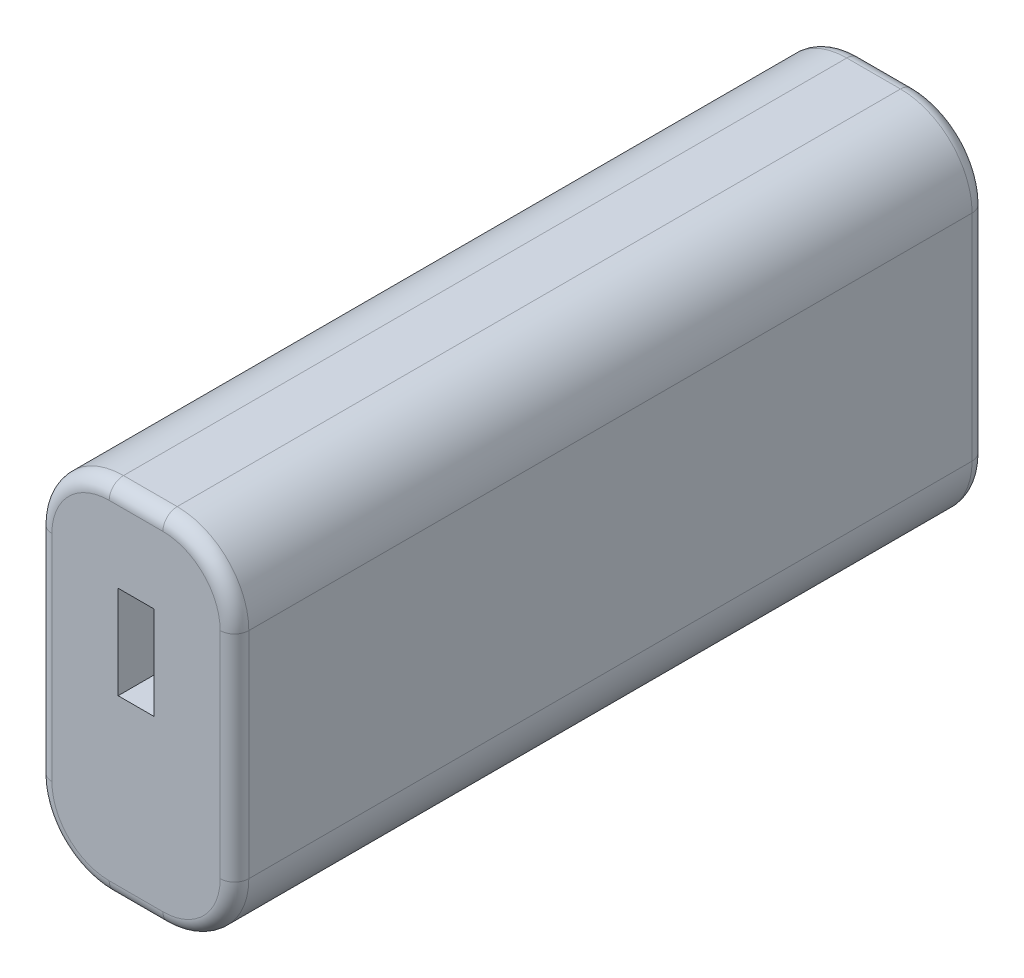
ISO-10303-21;
HEADER;
FILE_DESCRIPTION(('STEP AP214'),'2;1');
FILE_NAME('part.step','',(''),(''),'','','');
FILE_SCHEMA(('AUTOMOTIVE_DESIGN { 1 0 10303 214 1 1 1 1 }'));
ENDSEC;
DATA;
#1=APPLICATION_CONTEXT('core data for automotive mechanical design processes');
#2=APPLICATION_PROTOCOL_DEFINITION('international standard','automotive_design',2000,#1);
#3=PRODUCT_CONTEXT('',#1,'mechanical');
#4=PRODUCT('Part','Part','',(#3));
#5=PRODUCT_RELATED_PRODUCT_CATEGORY('part','',(#4));
#6=PRODUCT_DEFINITION_FORMATION('','',#4);
#7=PRODUCT_DEFINITION_CONTEXT('part definition',#1,'design');
#8=PRODUCT_DEFINITION('design','',#6,#7);
#9=PRODUCT_DEFINITION_SHAPE('','',#8);
#10=(LENGTH_UNIT() NAMED_UNIT(*) SI_UNIT(.MILLI.,.METRE.));
#11=(NAMED_UNIT(*) PLANE_ANGLE_UNIT() SI_UNIT($,.RADIAN.));
#12=(NAMED_UNIT(*) SI_UNIT($,.STERADIAN.) SOLID_ANGLE_UNIT());
#13=UNCERTAINTY_MEASURE_WITH_UNIT(LENGTH_MEASURE(1.E-05),#10,'distance_accuracy_value','');
#14=(GEOMETRIC_REPRESENTATION_CONTEXT(3) GLOBAL_UNCERTAINTY_ASSIGNED_CONTEXT((#13)) GLOBAL_UNIT_ASSIGNED_CONTEXT((#10,
#11,#12)) REPRESENTATION_CONTEXT('',''));
#15=CARTESIAN_POINT('',(0.,0.,0.));
#16=DIRECTION('',(0.,0.,1.));
#17=DIRECTION('',(1.,0.,0.));
#18=AXIS2_PLACEMENT_3D('',#15,#16,#17);
#19=CARTESIAN_POINT('',(17.5,10.,105.));
#20=DIRECTION('',(0.,0.,-1.));
#21=DIRECTION('',(-1.,0.,0.));
#22=AXIS2_PLACEMENT_3D('',#19,#20,#21);
#23=CYLINDRICAL_SURFACE('',#22,10.);
#24=DIRECTION('',(0.,0.,-1.));
#25=VECTOR('',#24,1.);
#26=CARTESIAN_POINT('',(17.4999999999999,0.,105.));
#27=LINE('',#26,#25);
#28=CARTESIAN_POINT('',(17.4999999999999,0.,103.));
#29=VERTEX_POINT('',#28);
#30=CARTESIAN_POINT('',(17.4999999999999,0.,2.));
#31=VERTEX_POINT('',#30);
#32=EDGE_CURVE('E214',#29,#31,#27,.T.);
#33=ORIENTED_EDGE('',*,*,#32,.T.);
#34=CARTESIAN_POINT('',(17.5,10.,2.));
#35=DIRECTION('',(0.,0.,-1.));
#36=DIRECTION('',(-1.,0.,0.));
#37=AXIS2_PLACEMENT_3D('',#34,#35,#36);
#38=CIRCLE('',#37,10.);
#39=CARTESIAN_POINT('',(27.5,10.0000000000001,2.));
#40=VERTEX_POINT('',#39);
#41=EDGE_CURVE('E241',#31,#40,#38,.F.);
#42=ORIENTED_EDGE('',*,*,#41,.T.);
#43=DIRECTION('',(0.,0.,-1.));
#44=VECTOR('',#43,1.);
#45=CARTESIAN_POINT('',(27.5,10.0000000000001,105.));
#46=LINE('',#45,#44);
#47=CARTESIAN_POINT('',(27.5,10.0000000000001,103.));
#48=VERTEX_POINT('',#47);
#49=EDGE_CURVE('E236',#48,#40,#46,.T.);
#50=ORIENTED_EDGE('',*,*,#49,.F.);
#51=CARTESIAN_POINT('',(17.5,10.,103.));
#52=DIRECTION('',(0.,0.,-1.));
#53=DIRECTION('',(-1.,0.,0.));
#54=AXIS2_PLACEMENT_3D('',#51,#52,#53);
#55=CIRCLE('',#54,10.);
#56=EDGE_CURVE('E239',#48,#29,#55,.T.);
#57=ORIENTED_EDGE('',*,*,#56,.T.);
#58=EDGE_LOOP('',(#33,#42,#50,#57));
#59=FACE_BOUND('',#58,.T.);
#60=ADVANCED_FACE('F33',(#59),#23,.T.);
#61=CARTESIAN_POINT('',(27.5,39.9999999999999,105.));
#62=DIRECTION('',(-1.,0.,0.));
#63=DIRECTION('',(0.,0.,1.));
#64=AXIS2_PLACEMENT_3D('',#61,#62,#63);
#65=PLANE('',#64);
#66=DIRECTION('',(0.,0.,-1.));
#67=VECTOR('',#66,1.);
#68=CARTESIAN_POINT('',(27.5,39.9999999999999,105.));
#69=LINE('',#68,#67);
#70=CARTESIAN_POINT('',(27.5,39.9999999999999,103.));
#71=VERTEX_POINT('',#70);
#72=CARTESIAN_POINT('',(27.5,39.9999999999999,2.));
#73=VERTEX_POINT('',#72);
#74=EDGE_CURVE('E233',#71,#73,#69,.T.);
#75=ORIENTED_EDGE('',*,*,#74,.F.);
#76=DIRECTION('',(0.,1.,0.));
#77=VECTOR('',#76,1.);
#78=CARTESIAN_POINT('',(27.5,39.9999999999999,103.));
#79=LINE('',#78,#77);
#80=EDGE_CURVE('E11',#71,#48,#79,.F.);
#81=ORIENTED_EDGE('',*,*,#80,.T.);
#82=ORIENTED_EDGE('',*,*,#49,.T.);
#83=DIRECTION('',(0.,1.,0.));
#84=VECTOR('',#83,1.);
#85=CARTESIAN_POINT('',(27.5,39.9999999999999,2.));
#86=LINE('',#85,#84);
#87=EDGE_CURVE('E42',#40,#73,#86,.T.);
#88=ORIENTED_EDGE('',*,*,#87,.T.);
#89=EDGE_LOOP('',(#75,#81,#82,#88));
#90=FACE_BOUND('',#89,.T.);
#91=ADVANCED_FACE('F406',(#90),#65,.F.);
#92=CARTESIAN_POINT('',(17.5,40.,105.));
#93=DIRECTION('',(0.,0.,-1.));
#94=DIRECTION('',(-1.,0.,0.));
#95=AXIS2_PLACEMENT_3D('',#92,#93,#94);
#96=CYLINDRICAL_SURFACE('',#95,10.);
#97=ORIENTED_EDGE('',*,*,#74,.T.);
#98=CARTESIAN_POINT('',(17.5,40.,2.));
#99=DIRECTION('',(0.,0.,-1.));
#100=DIRECTION('',(-1.,0.,0.));
#101=AXIS2_PLACEMENT_3D('',#98,#99,#100);
#102=CIRCLE('',#101,10.);
#103=CARTESIAN_POINT('',(17.4999999999999,50.,2.));
#104=VERTEX_POINT('',#103);
#105=EDGE_CURVE('E283',#73,#104,#102,.F.);
#106=ORIENTED_EDGE('',*,*,#105,.T.);
#107=DIRECTION('',(0.,0.,-1.));
#108=VECTOR('',#107,1.);
#109=CARTESIAN_POINT('',(17.4999999999999,50.,105.));
#110=LINE('',#109,#108);
#111=CARTESIAN_POINT('',(17.4999999999999,50.,103.));
#112=VERTEX_POINT('',#111);
#113=EDGE_CURVE('E230',#112,#104,#110,.T.);
#114=ORIENTED_EDGE('',*,*,#113,.F.);
#115=CARTESIAN_POINT('',(17.5,40.,103.));
#116=DIRECTION('',(0.,0.,-1.));
#117=DIRECTION('',(-1.,0.,0.));
#118=AXIS2_PLACEMENT_3D('',#115,#116,#117);
#119=CIRCLE('',#118,10.);
#120=EDGE_CURVE('E281',#112,#71,#119,.T.);
#121=ORIENTED_EDGE('',*,*,#120,.T.);
#122=EDGE_LOOP('',(#97,#106,#114,#121));
#123=FACE_BOUND('',#122,.T.);
#124=ADVANCED_FACE('F435',(#123),#96,.T.);
#125=CARTESIAN_POINT('',(10.0000000000001,50.,105.));
#126=DIRECTION('',(0.,-1.,0.));
#127=DIRECTION('',(0.,0.,-1.));
#128=AXIS2_PLACEMENT_3D('',#125,#126,#127);
#129=PLANE('',#128);
#130=ORIENTED_EDGE('',*,*,#113,.T.);
#131=DIRECTION('',(-1.,0.,0.));
#132=VECTOR('',#131,1.);
#133=CARTESIAN_POINT('',(10.0000000000001,50.,2.));
#134=LINE('',#133,#132);
#135=CARTESIAN_POINT('',(10.0000000000001,50.,2.));
#136=VERTEX_POINT('',#135);
#137=EDGE_CURVE('E279',#104,#136,#134,.T.);
#138=ORIENTED_EDGE('',*,*,#137,.T.);
#139=DIRECTION('',(0.,0.,-1.));
#140=VECTOR('',#139,1.);
#141=CARTESIAN_POINT('',(10.0000000000001,50.,105.));
#142=LINE('',#141,#140);
#143=CARTESIAN_POINT('',(10.0000000000001,50.,103.));
#144=VERTEX_POINT('',#143);
#145=EDGE_CURVE('E227',#144,#136,#142,.T.);
#146=ORIENTED_EDGE('',*,*,#145,.F.);
#147=DIRECTION('',(-1.,0.,0.));
#148=VECTOR('',#147,1.);
#149=CARTESIAN_POINT('',(10.0000000000001,50.,103.));
#150=LINE('',#149,#148);
#151=EDGE_CURVE('E277',#144,#112,#150,.F.);
#152=ORIENTED_EDGE('',*,*,#151,.T.);
#153=EDGE_LOOP('',(#130,#138,#146,#152));
#154=FACE_BOUND('',#153,.T.);
#155=ADVANCED_FACE('F552',(#154),#129,.F.);
#156=CARTESIAN_POINT('',(10.,40.,105.));
#157=DIRECTION('',(0.,0.,-1.));
#158=DIRECTION('',(-1.,0.,0.));
#159=AXIS2_PLACEMENT_3D('',#156,#157,#158);
#160=CYLINDRICAL_SURFACE('',#159,10.);
#161=ORIENTED_EDGE('',*,*,#145,.T.);
#162=CARTESIAN_POINT('',(10.,40.,2.));
#163=DIRECTION('',(0.,0.,-1.));
#164=DIRECTION('',(-1.,0.,0.));
#165=AXIS2_PLACEMENT_3D('',#162,#163,#164);
#166=CIRCLE('',#165,10.);
#167=CARTESIAN_POINT('',(0.,39.9999999999999,2.));
#168=VERTEX_POINT('',#167);
#169=EDGE_CURVE('E275',#136,#168,#166,.F.);
#170=ORIENTED_EDGE('',*,*,#169,.T.);
#171=DIRECTION('',(0.,0.,-1.));
#172=VECTOR('',#171,1.);
#173=CARTESIAN_POINT('',(0.,39.9999999999999,105.));
#174=LINE('',#173,#172);
#175=CARTESIAN_POINT('',(0.,39.9999999999999,103.));
#176=VERTEX_POINT('',#175);
#177=EDGE_CURVE('E224',#176,#168,#174,.T.);
#178=ORIENTED_EDGE('',*,*,#177,.F.);
#179=CARTESIAN_POINT('',(10.,40.,103.));
#180=DIRECTION('',(0.,0.,-1.));
#181=DIRECTION('',(-1.,0.,0.));
#182=AXIS2_PLACEMENT_3D('',#179,#180,#181);
#183=CIRCLE('',#182,10.);
#184=EDGE_CURVE('E273',#176,#144,#183,.T.);
#185=ORIENTED_EDGE('',*,*,#184,.T.);
#186=EDGE_LOOP('',(#161,#170,#178,#185));
#187=FACE_BOUND('',#186,.T.);
#188=ADVANCED_FACE('F358',(#187),#160,.T.);
#189=CARTESIAN_POINT('',(0.,10.0000000000001,105.));
#190=DIRECTION('',(1.,0.,0.));
#191=DIRECTION('',(0.,0.,-1.));
#192=AXIS2_PLACEMENT_3D('',#189,#190,#191);
#193=PLANE('',#192);
#194=ORIENTED_EDGE('',*,*,#177,.T.);
#195=DIRECTION('',(0.,-1.,0.));
#196=VECTOR('',#195,1.);
#197=CARTESIAN_POINT('',(0.,10.0000000000001,2.));
#198=LINE('',#197,#196);
#199=CARTESIAN_POINT('',(0.,10.0000000000001,2.));
#200=VERTEX_POINT('',#199);
#201=EDGE_CURVE('E271',#168,#200,#198,.T.);
#202=ORIENTED_EDGE('',*,*,#201,.T.);
#203=DIRECTION('',(0.,0.,-1.));
#204=VECTOR('',#203,1.);
#205=CARTESIAN_POINT('',(0.,10.0000000000001,105.));
#206=LINE('',#205,#204);
#207=CARTESIAN_POINT('',(0.,10.0000000000001,103.));
#208=VERTEX_POINT('',#207);
#209=EDGE_CURVE('E221',#208,#200,#206,.T.);
#210=ORIENTED_EDGE('',*,*,#209,.F.);
#211=DIRECTION('',(0.,-1.,0.));
#212=VECTOR('',#211,1.);
#213=CARTESIAN_POINT('',(0.,10.0000000000001,103.));
#214=LINE('',#213,#212);
#215=EDGE_CURVE('E269',#208,#176,#214,.F.);
#216=ORIENTED_EDGE('',*,*,#215,.T.);
#217=EDGE_LOOP('',(#194,#202,#210,#216));
#218=FACE_BOUND('',#217,.T.);
#219=ADVANCED_FACE('F355',(#218),#193,.F.);
#220=CARTESIAN_POINT('',(10.,10.,105.));
#221=DIRECTION('',(0.,0.,-1.));
#222=DIRECTION('',(-1.,0.,0.));
#223=AXIS2_PLACEMENT_3D('',#220,#221,#222);
#224=CYLINDRICAL_SURFACE('',#223,10.);
#225=ORIENTED_EDGE('',*,*,#209,.T.);
#226=CARTESIAN_POINT('',(10.,10.,2.));
#227=DIRECTION('',(0.,0.,-1.));
#228=DIRECTION('',(-1.,0.,0.));
#229=AXIS2_PLACEMENT_3D('',#226,#227,#228);
#230=CIRCLE('',#229,10.);
#231=CARTESIAN_POINT('',(10.0000000000001,0.,2.));
#232=VERTEX_POINT('',#231);
#233=EDGE_CURVE('E267',#200,#232,#230,.F.);
#234=ORIENTED_EDGE('',*,*,#233,.T.);
#235=DIRECTION('',(0.,0.,-1.));
#236=VECTOR('',#235,1.);
#237=CARTESIAN_POINT('',(10.0000000000001,0.,105.));
#238=LINE('',#237,#236);
#239=CARTESIAN_POINT('',(10.0000000000001,0.,103.));
#240=VERTEX_POINT('',#239);
#241=EDGE_CURVE('E217',#240,#232,#238,.T.);
#242=ORIENTED_EDGE('',*,*,#241,.F.);
#243=CARTESIAN_POINT('',(10.,10.,103.));
#244=DIRECTION('',(0.,0.,-1.));
#245=DIRECTION('',(-1.,0.,0.));
#246=AXIS2_PLACEMENT_3D('',#243,#244,#245);
#247=CIRCLE('',#246,10.);
#248=EDGE_CURVE('E265',#240,#208,#247,.T.);
#249=ORIENTED_EDGE('',*,*,#248,.T.);
#250=EDGE_LOOP('',(#225,#234,#242,#249));
#251=FACE_BOUND('',#250,.T.);
#252=ADVANCED_FACE('F381',(#251),#224,.T.);
#253=CARTESIAN_POINT('',(17.4999999999999,0.,105.));
#254=DIRECTION('',(0.,1.,0.));
#255=DIRECTION('',(0.,0.,1.));
#256=AXIS2_PLACEMENT_3D('',#253,#254,#255);
#257=PLANE('',#256);
#258=ORIENTED_EDGE('',*,*,#241,.T.);
#259=DIRECTION('',(1.,0.,0.));
#260=VECTOR('',#259,1.);
#261=CARTESIAN_POINT('',(17.4999999999999,0.,2.));
#262=LINE('',#261,#260);
#263=EDGE_CURVE('E263',#232,#31,#262,.T.);
#264=ORIENTED_EDGE('',*,*,#263,.T.);
#265=ORIENTED_EDGE('',*,*,#32,.F.);
#266=DIRECTION('',(1.,0.,0.));
#267=VECTOR('',#266,1.);
#268=CARTESIAN_POINT('',(17.4999999999999,0.,103.));
#269=LINE('',#268,#267);
#270=EDGE_CURVE('E261',#29,#240,#269,.F.);
#271=ORIENTED_EDGE('',*,*,#270,.T.);
#272=EDGE_LOOP('',(#258,#264,#265,#271));
#273=FACE_BOUND('',#272,.T.);
#274=ADVANCED_FACE('F385',(#273),#257,.F.);
#275=CARTESIAN_POINT('',(17.5,10.,105.));
#276=DIRECTION('',(0.,0.,-1.));
#277=DIRECTION('',(-1.,0.,0.));
#278=AXIS2_PLACEMENT_3D('',#275,#276,#277);
#279=PLANE('',#278);
#280=DIRECTION('',(-1.,0.,0.));
#281=VECTOR('',#280,1.);
#282=CARTESIAN_POINT('',(13.75,38.,105.));
#283=LINE('',#282,#281);
#284=CARTESIAN_POINT('',(16.25,38.,105.));
#285=VERTEX_POINT('',#284);
#286=CARTESIAN_POINT('',(11.25,38.,105.));
#287=VERTEX_POINT('',#286);
#288=EDGE_CURVE('E188',#285,#287,#283,.T.);
#289=ORIENTED_EDGE('',*,*,#288,.F.);
#290=DIRECTION('',(0.,1.,0.));
#291=VECTOR('',#290,1.);
#292=CARTESIAN_POINT('',(16.25,38.,105.));
#293=LINE('',#292,#291);
#294=CARTESIAN_POINT('',(16.25,25.,105.));
#295=VERTEX_POINT('',#294);
#296=EDGE_CURVE('E50',#295,#285,#293,.T.);
#297=ORIENTED_EDGE('',*,*,#296,.F.);
#298=DIRECTION('',(1.,0.,0.));
#299=VECTOR('',#298,1.);
#300=CARTESIAN_POINT('',(16.25,25.,105.));
#301=LINE('',#300,#299);
#302=CARTESIAN_POINT('',(11.25,25.,105.));
#303=VERTEX_POINT('',#302);
#304=EDGE_CURVE('E204',#303,#295,#301,.T.);
#305=ORIENTED_EDGE('',*,*,#304,.F.);
#306=DIRECTION('',(0.,-1.,0.));
#307=VECTOR('',#306,1.);
#308=CARTESIAN_POINT('',(11.25,25.,105.));
#309=LINE('',#308,#307);
#310=EDGE_CURVE('E202',#287,#303,#309,.T.);
#311=ORIENTED_EDGE('',*,*,#310,.F.);
#312=EDGE_LOOP('',(#289,#297,#305,#311));
#313=FACE_BOUND('',#312,.T.);
#314=CARTESIAN_POINT('',(17.5,10.,105.));
#315=DIRECTION('',(0.,0.,-1.));
#316=DIRECTION('',(-1.,0.,0.));
#317=AXIS2_PLACEMENT_3D('',#314,#315,#316);
#318=CIRCLE('',#317,8.);
#319=CARTESIAN_POINT('',(17.4999999999999,2.,105.));
#320=VERTEX_POINT('',#319);
#321=CARTESIAN_POINT('',(25.5,10.0000000000001,105.));
#322=VERTEX_POINT('',#321);
#323=EDGE_CURVE('E58',#320,#322,#318,.F.);
#324=ORIENTED_EDGE('',*,*,#323,.T.);
#325=DIRECTION('',(0.,1.,0.));
#326=VECTOR('',#325,1.);
#327=CARTESIAN_POINT('',(25.5,10.,105.));
#328=LINE('',#327,#326);
#329=CARTESIAN_POINT('',(25.5,39.9999999999999,105.));
#330=VERTEX_POINT('',#329);
#331=EDGE_CURVE('E298',#322,#330,#328,.T.);
#332=ORIENTED_EDGE('',*,*,#331,.T.);
#333=CARTESIAN_POINT('',(17.5,40.,105.));
#334=DIRECTION('',(0.,0.,-1.));
#335=DIRECTION('',(-1.,0.,0.));
#336=AXIS2_PLACEMENT_3D('',#333,#334,#335);
#337=CIRCLE('',#336,8.);
#338=CARTESIAN_POINT('',(17.4999999999999,48.,105.));
#339=VERTEX_POINT('',#338);
#340=EDGE_CURVE('E285',#330,#339,#337,.F.);
#341=ORIENTED_EDGE('',*,*,#340,.T.);
#342=DIRECTION('',(-1.,0.,0.));
#343=VECTOR('',#342,1.);
#344=CARTESIAN_POINT('',(17.5,48.,105.));
#345=LINE('',#344,#343);
#346=CARTESIAN_POINT('',(10.0000000000001,48.,105.));
#347=VERTEX_POINT('',#346);
#348=EDGE_CURVE('E287',#339,#347,#345,.T.);
#349=ORIENTED_EDGE('',*,*,#348,.T.);
#350=CARTESIAN_POINT('',(10.,40.,105.));
#351=DIRECTION('',(0.,0.,-1.));
#352=DIRECTION('',(-1.,0.,0.));
#353=AXIS2_PLACEMENT_3D('',#350,#351,#352);
#354=CIRCLE('',#353,8.);
#355=CARTESIAN_POINT('',(2.,39.9999999999999,105.));
#356=VERTEX_POINT('',#355);
#357=EDGE_CURVE('E289',#347,#356,#354,.F.);
#358=ORIENTED_EDGE('',*,*,#357,.T.);
#359=DIRECTION('',(0.,-1.,0.));
#360=VECTOR('',#359,1.);
#361=CARTESIAN_POINT('',(2.,10.,105.));
#362=LINE('',#361,#360);
#363=CARTESIAN_POINT('',(2.,10.0000000000001,105.));
#364=VERTEX_POINT('',#363);
#365=EDGE_CURVE('E291',#356,#364,#362,.T.);
#366=ORIENTED_EDGE('',*,*,#365,.T.);
#367=CARTESIAN_POINT('',(10.,10.,105.));
#368=DIRECTION('',(0.,0.,-1.));
#369=DIRECTION('',(-1.,0.,0.));
#370=AXIS2_PLACEMENT_3D('',#367,#368,#369);
#371=CIRCLE('',#370,8.);
#372=CARTESIAN_POINT('',(10.0000000000001,2.,105.));
#373=VERTEX_POINT('',#372);
#374=EDGE_CURVE('E293',#364,#373,#371,.F.);
#375=ORIENTED_EDGE('',*,*,#374,.T.);
#376=DIRECTION('',(1.,0.,0.));
#377=VECTOR('',#376,1.);
#378=CARTESIAN_POINT('',(17.5,2.,105.));
#379=LINE('',#378,#377);
#380=EDGE_CURVE('E295',#373,#320,#379,.T.);
#381=ORIENTED_EDGE('',*,*,#380,.T.);
#382=EDGE_LOOP('',(#324,#332,#341,#349,#358,#366,#375,#381));
#383=FACE_BOUND('',#382,.T.);
#384=ADVANCED_FACE('F419',(#313,#383),#279,.F.);
#385=CARTESIAN_POINT('',(17.5,10.,0.));
#386=DIRECTION('',(0.,0.,-1.));
#387=DIRECTION('',(-1.,0.,0.));
#388=AXIS2_PLACEMENT_3D('',#385,#386,#387);
#389=PLANE('',#388);
#390=DIRECTION('',(0.,1.,0.));
#391=VECTOR('',#390,1.);
#392=CARTESIAN_POINT('',(25.5,10.0000000000001,0.));
#393=LINE('',#392,#391);
#394=CARTESIAN_POINT('',(25.5,39.9999999999999,0.));
#395=VERTEX_POINT('',#394);
#396=CARTESIAN_POINT('',(25.5,10.0000000000001,0.));
#397=VERTEX_POINT('',#396);
#398=EDGE_CURVE('E244',#395,#397,#393,.F.);
#399=ORIENTED_EDGE('',*,*,#398,.T.);
#400=CARTESIAN_POINT('',(17.5,10.,0.));
#401=DIRECTION('',(0.,0.,-1.));
#402=DIRECTION('',(-1.,0.,0.));
#403=AXIS2_PLACEMENT_3D('',#400,#401,#402);
#404=CIRCLE('',#403,8.);
#405=CARTESIAN_POINT('',(17.4999999999999,2.,0.));
#406=VERTEX_POINT('',#405);
#407=EDGE_CURVE('E258',#397,#406,#404,.T.);
#408=ORIENTED_EDGE('',*,*,#407,.T.);
#409=DIRECTION('',(1.,0.,0.));
#410=VECTOR('',#409,1.);
#411=CARTESIAN_POINT('',(10.0000000000001,2.,0.));
#412=LINE('',#411,#410);
#413=CARTESIAN_POINT('',(10.0000000000001,2.,0.));
#414=VERTEX_POINT('',#413);
#415=EDGE_CURVE('E256',#406,#414,#412,.F.);
#416=ORIENTED_EDGE('',*,*,#415,.T.);
#417=CARTESIAN_POINT('',(10.,10.,0.));
#418=DIRECTION('',(0.,0.,-1.));
#419=DIRECTION('',(-1.,0.,0.));
#420=AXIS2_PLACEMENT_3D('',#417,#418,#419);
#421=CIRCLE('',#420,8.);
#422=CARTESIAN_POINT('',(2.,10.0000000000001,0.));
#423=VERTEX_POINT('',#422);
#424=EDGE_CURVE('E254',#414,#423,#421,.T.);
#425=ORIENTED_EDGE('',*,*,#424,.T.);
#426=DIRECTION('',(0.,-1.,0.));
#427=VECTOR('',#426,1.);
#428=CARTESIAN_POINT('',(2.,39.9999999999999,0.));
#429=LINE('',#428,#427);
#430=CARTESIAN_POINT('',(2.,39.9999999999999,0.));
#431=VERTEX_POINT('',#430);
#432=EDGE_CURVE('E252',#423,#431,#429,.F.);
#433=ORIENTED_EDGE('',*,*,#432,.T.);
#434=CARTESIAN_POINT('',(10.,40.,0.));
#435=DIRECTION('',(0.,0.,-1.));
#436=DIRECTION('',(-1.,0.,0.));
#437=AXIS2_PLACEMENT_3D('',#434,#435,#436);
#438=CIRCLE('',#437,8.);
#439=CARTESIAN_POINT('',(10.0000000000001,48.,0.));
#440=VERTEX_POINT('',#439);
#441=EDGE_CURVE('E250',#431,#440,#438,.T.);
#442=ORIENTED_EDGE('',*,*,#441,.T.);
#443=DIRECTION('',(-1.,0.,0.));
#444=VECTOR('',#443,1.);
#445=CARTESIAN_POINT('',(17.4999999999999,48.,0.));
#446=LINE('',#445,#444);
#447=CARTESIAN_POINT('',(17.4999999999999,48.,0.));
#448=VERTEX_POINT('',#447);
#449=EDGE_CURVE('E248',#440,#448,#446,.F.);
#450=ORIENTED_EDGE('',*,*,#449,.T.);
#451=CARTESIAN_POINT('',(17.5,40.,0.));
#452=DIRECTION('',(0.,0.,-1.));
#453=DIRECTION('',(-1.,0.,0.));
#454=AXIS2_PLACEMENT_3D('',#451,#452,#453);
#455=CIRCLE('',#454,8.);
#456=EDGE_CURVE('E246',#448,#395,#455,.T.);
#457=ORIENTED_EDGE('',*,*,#456,.T.);
#458=EDGE_LOOP('',(#399,#408,#416,#425,#433,#442,#450,#457));
#459=FACE_BOUND('',#458,.T.);
#460=ADVANCED_FACE('F373',(#459),#389,.T.);
#461=CARTESIAN_POINT('',(10.,40.,2.));
#462=DIRECTION('',(0.,0.,-1.));
#463=DIRECTION('',(-1.,0.,0.));
#464=AXIS2_PLACEMENT_3D('',#461,#462,#463);
#465=TOROIDAL_SURFACE('',#464,8.,2.);
#466=CARTESIAN_POINT('',(10.0000000000001,48.,2.));
#467=DIRECTION('',(1.,0.,0.));
#468=DIRECTION('',(0.,1.,0.));
#469=AXIS2_PLACEMENT_3D('',#466,#467,#468);
#470=CIRCLE('',#469,2.);
#471=EDGE_CURVE('E317',#440,#136,#470,.T.);
#472=ORIENTED_EDGE('',*,*,#471,.F.);
#473=ORIENTED_EDGE('',*,*,#441,.F.);
#474=CARTESIAN_POINT('',(2.,39.9999999999999,2.));
#475=DIRECTION('',(0.,-1.,0.));
#476=DIRECTION('',(1.,0.,0.));
#477=AXIS2_PLACEMENT_3D('',#474,#475,#476);
#478=CIRCLE('',#477,2.);
#479=EDGE_CURVE('E218',#168,#431,#478,.T.);
#480=ORIENTED_EDGE('',*,*,#479,.F.);
#481=ORIENTED_EDGE('',*,*,#169,.F.);
#482=EDGE_LOOP('',(#472,#473,#480,#481));
#483=FACE_BOUND('',#482,.T.);
#484=ADVANCED_FACE('F363',(#483),#465,.T.);
#485=CARTESIAN_POINT('',(2.,10.0000000000001,2.));
#486=DIRECTION('',(0.,1.,0.));
#487=DIRECTION('',(0.,0.,1.));
#488=AXIS2_PLACEMENT_3D('',#485,#486,#487);
#489=CYLINDRICAL_SURFACE('',#488,2.);
#490=ORIENTED_EDGE('',*,*,#479,.T.);
#491=ORIENTED_EDGE('',*,*,#432,.F.);
#492=CARTESIAN_POINT('',(2.,10.0000000000001,2.));
#493=DIRECTION('',(0.,-1.,0.));
#494=DIRECTION('',(0.,0.,-1.));
#495=AXIS2_PLACEMENT_3D('',#492,#493,#494);
#496=CIRCLE('',#495,2.);
#497=EDGE_CURVE('E314',#200,#423,#496,.T.);
#498=ORIENTED_EDGE('',*,*,#497,.F.);
#499=ORIENTED_EDGE('',*,*,#201,.F.);
#500=EDGE_LOOP('',(#490,#491,#498,#499));
#501=FACE_BOUND('',#500,.T.);
#502=ADVANCED_FACE('F377',(#501),#489,.T.);
#503=CARTESIAN_POINT('',(10.0000000000001,48.,2.));
#504=DIRECTION('',(1.,0.,0.));
#505=DIRECTION('',(0.,0.,-1.));
#506=AXIS2_PLACEMENT_3D('',#503,#504,#505);
#507=CYLINDRICAL_SURFACE('',#506,2.);
#508=ORIENTED_EDGE('',*,*,#471,.T.);
#509=ORIENTED_EDGE('',*,*,#137,.F.);
#510=CARTESIAN_POINT('',(17.4999999999999,48.,2.));
#511=DIRECTION('',(1.,0.,0.));
#512=DIRECTION('',(0.,0.,-1.));
#513=AXIS2_PLACEMENT_3D('',#510,#511,#512);
#514=CIRCLE('',#513,2.);
#515=EDGE_CURVE('E311',#448,#104,#514,.T.);
#516=ORIENTED_EDGE('',*,*,#515,.F.);
#517=ORIENTED_EDGE('',*,*,#449,.F.);
#518=EDGE_LOOP('',(#508,#509,#516,#517));
#519=FACE_BOUND('',#518,.T.);
#520=ADVANCED_FACE('F369',(#519),#507,.T.);
#521=CARTESIAN_POINT('',(10.,10.,2.));
#522=DIRECTION('',(0.,0.,-1.));
#523=DIRECTION('',(-1.,0.,0.));
#524=AXIS2_PLACEMENT_3D('',#521,#522,#523);
#525=TOROIDAL_SURFACE('',#524,8.,2.);
#526=ORIENTED_EDGE('',*,*,#497,.T.);
#527=ORIENTED_EDGE('',*,*,#424,.F.);
#528=CARTESIAN_POINT('',(10.0000000000001,2.,2.));
#529=DIRECTION('',(1.,0.,0.));
#530=DIRECTION('',(0.,1.,0.));
#531=AXIS2_PLACEMENT_3D('',#528,#529,#530);
#532=CIRCLE('',#531,2.);
#533=EDGE_CURVE('E308',#232,#414,#532,.T.);
#534=ORIENTED_EDGE('',*,*,#533,.F.);
#535=ORIENTED_EDGE('',*,*,#233,.F.);
#536=EDGE_LOOP('',(#526,#527,#534,#535));
#537=FACE_BOUND('',#536,.T.);
#538=ADVANCED_FACE('F391',(#537),#525,.T.);
#539=CARTESIAN_POINT('',(17.5,40.,2.));
#540=DIRECTION('',(0.,0.,-1.));
#541=DIRECTION('',(-1.,0.,0.));
#542=AXIS2_PLACEMENT_3D('',#539,#540,#541);
#543=TOROIDAL_SURFACE('',#542,8.,2.);
#544=ORIENTED_EDGE('',*,*,#515,.T.);
#545=ORIENTED_EDGE('',*,*,#105,.F.);
#546=CARTESIAN_POINT('',(25.5,39.9999999999999,2.));
#547=DIRECTION('',(0.,-1.,0.));
#548=DIRECTION('',(1.,0.,0.));
#549=AXIS2_PLACEMENT_3D('',#546,#547,#548);
#550=CIRCLE('',#549,2.);
#551=EDGE_CURVE('E305',#395,#73,#550,.T.);
#552=ORIENTED_EDGE('',*,*,#551,.F.);
#553=ORIENTED_EDGE('',*,*,#456,.F.);
#554=EDGE_LOOP('',(#544,#545,#552,#553));
#555=FACE_BOUND('',#554,.T.);
#556=ADVANCED_FACE('F447',(#555),#543,.T.);
#557=CARTESIAN_POINT('',(17.4999999999999,2.,2.));
#558=DIRECTION('',(-1.,0.,0.));
#559=DIRECTION('',(0.,0.,1.));
#560=AXIS2_PLACEMENT_3D('',#557,#558,#559);
#561=CYLINDRICAL_SURFACE('',#560,2.);
#562=ORIENTED_EDGE('',*,*,#533,.T.);
#563=ORIENTED_EDGE('',*,*,#415,.F.);
#564=CARTESIAN_POINT('',(17.4999999999999,2.,2.));
#565=DIRECTION('',(1.,0.,0.));
#566=DIRECTION('',(0.,0.,-1.));
#567=AXIS2_PLACEMENT_3D('',#564,#565,#566);
#568=CIRCLE('',#567,2.);
#569=EDGE_CURVE('E303',#31,#406,#568,.T.);
#570=ORIENTED_EDGE('',*,*,#569,.F.);
#571=ORIENTED_EDGE('',*,*,#263,.F.);
#572=EDGE_LOOP('',(#562,#563,#570,#571));
#573=FACE_BOUND('',#572,.T.);
#574=ADVANCED_FACE('F395',(#573),#561,.T.);
#575=CARTESIAN_POINT('',(25.5,39.9999999999999,2.));
#576=DIRECTION('',(0.,-1.,0.));
#577=DIRECTION('',(0.,0.,-1.));
#578=AXIS2_PLACEMENT_3D('',#575,#576,#577);
#579=CYLINDRICAL_SURFACE('',#578,2.);
#580=ORIENTED_EDGE('',*,*,#551,.T.);
#581=ORIENTED_EDGE('',*,*,#87,.F.);
#582=CARTESIAN_POINT('',(25.5,10.0000000000001,2.));
#583=DIRECTION('',(0.,-1.,0.));
#584=DIRECTION('',(1.,0.,0.));
#585=AXIS2_PLACEMENT_3D('',#582,#583,#584);
#586=CIRCLE('',#585,2.);
#587=EDGE_CURVE('E301',#397,#40,#586,.T.);
#588=ORIENTED_EDGE('',*,*,#587,.F.);
#589=ORIENTED_EDGE('',*,*,#398,.F.);
#590=EDGE_LOOP('',(#580,#581,#588,#589));
#591=FACE_BOUND('',#590,.T.);
#592=ADVANCED_FACE('F441',(#591),#579,.T.);
#593=CARTESIAN_POINT('',(17.5,10.,2.));
#594=DIRECTION('',(0.,0.,-1.));
#595=DIRECTION('',(-1.,0.,0.));
#596=AXIS2_PLACEMENT_3D('',#593,#594,#595);
#597=TOROIDAL_SURFACE('',#596,8.,2.);
#598=ORIENTED_EDGE('',*,*,#569,.T.);
#599=ORIENTED_EDGE('',*,*,#407,.F.);
#600=ORIENTED_EDGE('',*,*,#587,.T.);
#601=ORIENTED_EDGE('',*,*,#41,.F.);
#602=EDGE_LOOP('',(#598,#599,#600,#601));
#603=FACE_BOUND('',#602,.T.);
#604=ADVANCED_FACE('F399',(#603),#597,.T.);
#605=CARTESIAN_POINT('',(2.,10.,103.));
#606=DIRECTION('',(0.,-1.,0.));
#607=DIRECTION('',(0.,0.,-1.));
#608=AXIS2_PLACEMENT_3D('',#605,#606,#607);
#609=CYLINDRICAL_SURFACE('',#608,2.);
#610=CARTESIAN_POINT('',(2.,39.9999999999999,103.));
#611=DIRECTION('',(0.,1.,0.));
#612=DIRECTION('',(0.,0.,1.));
#613=AXIS2_PLACEMENT_3D('',#610,#611,#612);
#614=CIRCLE('',#613,2.);
#615=EDGE_CURVE('E336',#176,#356,#614,.T.);
#616=ORIENTED_EDGE('',*,*,#615,.F.);
#617=ORIENTED_EDGE('',*,*,#215,.F.);
#618=CARTESIAN_POINT('',(2.,10.0000000000001,103.));
#619=DIRECTION('',(0.,-1.,0.));
#620=DIRECTION('',(1.,0.,0.));
#621=AXIS2_PLACEMENT_3D('',#618,#619,#620);
#622=CIRCLE('',#621,2.);
#623=EDGE_CURVE('E37',#364,#208,#622,.T.);
#624=ORIENTED_EDGE('',*,*,#623,.F.);
#625=ORIENTED_EDGE('',*,*,#365,.F.);
#626=EDGE_LOOP('',(#616,#617,#624,#625));
#627=FACE_BOUND('',#626,.T.);
#628=ADVANCED_FACE('F35',(#627),#609,.T.);
#629=CARTESIAN_POINT('',(10.,10.,103.));
#630=DIRECTION('',(0.,0.,-1.));
#631=DIRECTION('',(-1.,0.,0.));
#632=AXIS2_PLACEMENT_3D('',#629,#630,#631);
#633=TOROIDAL_SURFACE('',#632,8.,2.);
#634=ORIENTED_EDGE('',*,*,#623,.T.);
#635=ORIENTED_EDGE('',*,*,#248,.F.);
#636=CARTESIAN_POINT('',(10.0000000000001,2.,103.));
#637=DIRECTION('',(1.,0.,0.));
#638=DIRECTION('',(0.,0.,-1.));
#639=AXIS2_PLACEMENT_3D('',#636,#637,#638);
#640=CIRCLE('',#639,2.);
#641=EDGE_CURVE('E334',#373,#240,#640,.T.);
#642=ORIENTED_EDGE('',*,*,#641,.F.);
#643=ORIENTED_EDGE('',*,*,#374,.F.);
#644=EDGE_LOOP('',(#634,#635,#642,#643));
#645=FACE_BOUND('',#644,.T.);
#646=ADVANCED_FACE('F347',(#645),#633,.T.);
#647=CARTESIAN_POINT('',(10.,40.,103.));
#648=DIRECTION('',(0.,0.,-1.));
#649=DIRECTION('',(-1.,0.,0.));
#650=AXIS2_PLACEMENT_3D('',#647,#648,#649);
#651=TOROIDAL_SURFACE('',#650,8.,2.);
#652=ORIENTED_EDGE('',*,*,#615,.T.);
#653=ORIENTED_EDGE('',*,*,#357,.F.);
#654=CARTESIAN_POINT('',(10.0000000000001,48.,103.));
#655=DIRECTION('',(1.,0.,0.));
#656=DIRECTION('',(0.,1.,0.));
#657=AXIS2_PLACEMENT_3D('',#654,#655,#656);
#658=CIRCLE('',#657,2.);
#659=EDGE_CURVE('E331',#144,#347,#658,.T.);
#660=ORIENTED_EDGE('',*,*,#659,.F.);
#661=ORIENTED_EDGE('',*,*,#184,.F.);
#662=EDGE_LOOP('',(#652,#653,#660,#661));
#663=FACE_BOUND('',#662,.T.);
#664=ADVANCED_FACE('F475',(#663),#651,.T.);
#665=CARTESIAN_POINT('',(17.5,2.,103.));
#666=DIRECTION('',(1.,0.,0.));
#667=DIRECTION('',(0.,0.,-1.));
#668=AXIS2_PLACEMENT_3D('',#665,#666,#667);
#669=CYLINDRICAL_SURFACE('',#668,2.);
#670=ORIENTED_EDGE('',*,*,#641,.T.);
#671=ORIENTED_EDGE('',*,*,#270,.F.);
#672=CARTESIAN_POINT('',(17.4999999999999,2.,103.));
#673=DIRECTION('',(1.,0.,0.));
#674=DIRECTION('',(0.,1.,0.));
#675=AXIS2_PLACEMENT_3D('',#672,#673,#674);
#676=CIRCLE('',#675,2.);
#677=EDGE_CURVE('E328',#320,#29,#676,.T.);
#678=ORIENTED_EDGE('',*,*,#677,.F.);
#679=ORIENTED_EDGE('',*,*,#380,.F.);
#680=EDGE_LOOP('',(#670,#671,#678,#679));
#681=FACE_BOUND('',#680,.T.);
#682=ADVANCED_FACE('F471',(#681),#669,.T.);
#683=CARTESIAN_POINT('',(17.5,48.,103.));
#684=DIRECTION('',(-1.,0.,0.));
#685=DIRECTION('',(0.,0.,1.));
#686=AXIS2_PLACEMENT_3D('',#683,#684,#685);
#687=CYLINDRICAL_SURFACE('',#686,2.);
#688=ORIENTED_EDGE('',*,*,#659,.T.);
#689=ORIENTED_EDGE('',*,*,#348,.F.);
#690=CARTESIAN_POINT('',(17.4999999999999,48.,103.));
#691=DIRECTION('',(1.,0.,0.));
#692=DIRECTION('',(0.,0.,-1.));
#693=AXIS2_PLACEMENT_3D('',#690,#691,#692);
#694=CIRCLE('',#693,2.);
#695=EDGE_CURVE('E325',#112,#339,#694,.T.);
#696=ORIENTED_EDGE('',*,*,#695,.F.);
#697=ORIENTED_EDGE('',*,*,#151,.F.);
#698=EDGE_LOOP('',(#688,#689,#696,#697));
#699=FACE_BOUND('',#698,.T.);
#700=ADVANCED_FACE('F467',(#699),#687,.T.);
#701=CARTESIAN_POINT('',(17.5,10.,103.));
#702=DIRECTION('',(0.,0.,-1.));
#703=DIRECTION('',(-1.,0.,0.));
#704=AXIS2_PLACEMENT_3D('',#701,#702,#703);
#705=TOROIDAL_SURFACE('',#704,8.,2.);
#706=ORIENTED_EDGE('',*,*,#677,.T.);
#707=ORIENTED_EDGE('',*,*,#56,.F.);
#708=CARTESIAN_POINT('',(25.5,10.0000000000001,103.));
#709=DIRECTION('',(0.,1.,0.));
#710=DIRECTION('',(0.,0.,1.));
#711=AXIS2_PLACEMENT_3D('',#708,#709,#710);
#712=CIRCLE('',#711,2.);
#713=EDGE_CURVE('E323',#322,#48,#712,.T.);
#714=ORIENTED_EDGE('',*,*,#713,.F.);
#715=ORIENTED_EDGE('',*,*,#323,.F.);
#716=EDGE_LOOP('',(#706,#707,#714,#715));
#717=FACE_BOUND('',#716,.T.);
#718=ADVANCED_FACE('F464',(#717),#705,.T.);
#719=CARTESIAN_POINT('',(17.5,40.,103.));
#720=DIRECTION('',(0.,0.,-1.));
#721=DIRECTION('',(-1.,0.,0.));
#722=AXIS2_PLACEMENT_3D('',#719,#720,#721);
#723=TOROIDAL_SURFACE('',#722,8.,2.);
#724=ORIENTED_EDGE('',*,*,#695,.T.);
#725=ORIENTED_EDGE('',*,*,#340,.F.);
#726=CARTESIAN_POINT('',(25.5,39.9999999999999,103.));
#727=DIRECTION('',(0.,-1.,0.));
#728=DIRECTION('',(0.,0.,-1.));
#729=AXIS2_PLACEMENT_3D('',#726,#727,#728);
#730=CIRCLE('',#729,2.);
#731=EDGE_CURVE('E210',#71,#330,#730,.T.);
#732=ORIENTED_EDGE('',*,*,#731,.F.);
#733=ORIENTED_EDGE('',*,*,#120,.F.);
#734=EDGE_LOOP('',(#724,#725,#732,#733));
#735=FACE_BOUND('',#734,.T.);
#736=ADVANCED_FACE('F416',(#735),#723,.T.);
#737=CARTESIAN_POINT('',(25.5,10.,103.));
#738=DIRECTION('',(0.,1.,0.));
#739=DIRECTION('',(0.,0.,1.));
#740=AXIS2_PLACEMENT_3D('',#737,#738,#739);
#741=CYLINDRICAL_SURFACE('',#740,2.);
#742=ORIENTED_EDGE('',*,*,#713,.T.);
#743=ORIENTED_EDGE('',*,*,#80,.F.);
#744=ORIENTED_EDGE('',*,*,#731,.T.);
#745=ORIENTED_EDGE('',*,*,#331,.F.);
#746=EDGE_LOOP('',(#742,#743,#744,#745));
#747=FACE_BOUND('',#746,.T.);
#748=ADVANCED_FACE('F410',(#747),#741,.T.);
#749=CARTESIAN_POINT('',(16.25,38.,85.));
#750=DIRECTION('',(1.,0.,0.));
#751=DIRECTION('',(0.,0.,-1.));
#752=AXIS2_PLACEMENT_3D('',#749,#750,#751);
#753=PLANE('',#752);
#754=ORIENTED_EDGE('',*,*,#296,.T.);
#755=DIRECTION('',(0.,0.,1.));
#756=VECTOR('',#755,1.);
#757=CARTESIAN_POINT('',(16.25,38.,85.));
#758=LINE('',#757,#756);
#759=CARTESIAN_POINT('',(16.25,38.,85.));
#760=VERTEX_POINT('',#759);
#761=EDGE_CURVE('E208',#760,#285,#758,.T.);
#762=ORIENTED_EDGE('',*,*,#761,.F.);
#763=DIRECTION('',(0.,1.,0.));
#764=VECTOR('',#763,1.);
#765=CARTESIAN_POINT('',(16.25,38.,85.));
#766=LINE('',#765,#764);
#767=CARTESIAN_POINT('',(16.25,25.,85.));
#768=VERTEX_POINT('',#767);
#769=EDGE_CURVE('E181',#768,#760,#766,.T.);
#770=ORIENTED_EDGE('',*,*,#769,.F.);
#771=DIRECTION('',(0.,0.,1.));
#772=VECTOR('',#771,1.);
#773=CARTESIAN_POINT('',(16.25,25.,85.));
#774=LINE('',#773,#772);
#775=EDGE_CURVE('E211',#768,#295,#774,.T.);
#776=ORIENTED_EDGE('',*,*,#775,.T.);
#777=EDGE_LOOP('',(#754,#762,#770,#776));
#778=FACE_BOUND('',#777,.T.);
#779=ADVANCED_FACE('F461',(#778),#753,.F.);
#780=CARTESIAN_POINT('',(16.25,25.,85.));
#781=DIRECTION('',(0.,-1.,0.));
#782=DIRECTION('',(0.,0.,-1.));
#783=AXIS2_PLACEMENT_3D('',#780,#781,#782);
#784=PLANE('',#783);
#785=ORIENTED_EDGE('',*,*,#304,.T.);
#786=ORIENTED_EDGE('',*,*,#775,.F.);
#787=DIRECTION('',(1.,0.,0.));
#788=VECTOR('',#787,1.);
#789=CARTESIAN_POINT('',(16.25,25.,85.));
#790=LINE('',#789,#788);
#791=CARTESIAN_POINT('',(11.25,25.,85.));
#792=VERTEX_POINT('',#791);
#793=EDGE_CURVE('E196',#792,#768,#790,.T.);
#794=ORIENTED_EDGE('',*,*,#793,.F.);
#795=DIRECTION('',(0.,0.,1.));
#796=VECTOR('',#795,1.);
#797=CARTESIAN_POINT('',(11.25,25.,85.));
#798=LINE('',#797,#796);
#799=EDGE_CURVE('E192',#792,#303,#798,.T.);
#800=ORIENTED_EDGE('',*,*,#799,.T.);
#801=EDGE_LOOP('',(#785,#786,#794,#800));
#802=FACE_BOUND('',#801,.T.);
#803=ADVANCED_FACE('F602',(#802),#784,.F.);
#804=CARTESIAN_POINT('',(11.25,25.,85.));
#805=DIRECTION('',(-1.,0.,0.));
#806=DIRECTION('',(0.,0.,1.));
#807=AXIS2_PLACEMENT_3D('',#804,#805,#806);
#808=PLANE('',#807);
#809=ORIENTED_EDGE('',*,*,#310,.T.);
#810=ORIENTED_EDGE('',*,*,#799,.F.);
#811=DIRECTION('',(0.,-1.,0.));
#812=VECTOR('',#811,1.);
#813=CARTESIAN_POINT('',(11.25,25.,85.));
#814=LINE('',#813,#812);
#815=CARTESIAN_POINT('',(11.25,38.,85.));
#816=VERTEX_POINT('',#815);
#817=EDGE_CURVE('E179',#816,#792,#814,.T.);
#818=ORIENTED_EDGE('',*,*,#817,.F.);
#819=DIRECTION('',(0.,0.,1.));
#820=VECTOR('',#819,1.);
#821=CARTESIAN_POINT('',(11.25,38.,85.));
#822=LINE('',#821,#820);
#823=EDGE_CURVE('E185',#816,#287,#822,.T.);
#824=ORIENTED_EDGE('',*,*,#823,.T.);
#825=EDGE_LOOP('',(#809,#810,#818,#824));
#826=FACE_BOUND('',#825,.T.);
#827=ADVANCED_FACE('F194',(#826),#808,.F.);
#828=CARTESIAN_POINT('',(13.75,38.,85.));
#829=DIRECTION('',(0.,1.,0.));
#830=DIRECTION('',(0.,0.,1.));
#831=AXIS2_PLACEMENT_3D('',#828,#829,#830);
#832=PLANE('',#831);
#833=ORIENTED_EDGE('',*,*,#288,.T.);
#834=ORIENTED_EDGE('',*,*,#823,.F.);
#835=DIRECTION('',(-1.,0.,0.));
#836=VECTOR('',#835,1.);
#837=CARTESIAN_POINT('',(13.75,38.,85.));
#838=LINE('',#837,#836);
#839=EDGE_CURVE('E174',#760,#816,#838,.T.);
#840=ORIENTED_EDGE('',*,*,#839,.F.);
#841=ORIENTED_EDGE('',*,*,#761,.T.);
#842=EDGE_LOOP('',(#833,#834,#840,#841));
#843=FACE_BOUND('',#842,.T.);
#844=ADVANCED_FACE('F186',(#843),#832,.F.);
#845=CARTESIAN_POINT('',(0.,0.,85.));
#846=DIRECTION('',(0.,0.,-1.));
#847=DIRECTION('',(-1.,0.,0.));
#848=AXIS2_PLACEMENT_3D('',#845,#846,#847);
#849=PLANE('',#848);
#850=ORIENTED_EDGE('',*,*,#839,.T.);
#851=ORIENTED_EDGE('',*,*,#817,.T.);
#852=ORIENTED_EDGE('',*,*,#793,.T.);
#853=ORIENTED_EDGE('',*,*,#769,.T.);
#854=EDGE_LOOP('',(#850,#851,#852,#853));
#855=FACE_BOUND('',#854,.T.);
#856=ADVANCED_FACE('F176',(#855),#849,.F.);
#857=CLOSED_SHELL('',(#60,#91,#124,#155,#188,#219,#252,#274,#384,#460,#484,#502,#520,#538,#556,
#574,#592,#604,#628,#646,#664,#682,#700,#718,#736,#748,#779,#803,#827,#844,#856));
#858=MANIFOLD_SOLID_BREP('B2',#857);
#859=ADVANCED_BREP_SHAPE_REPRESENTATION('',(#18,#858),#14);
#860=SHAPE_DEFINITION_REPRESENTATION(#9,#859);
ENDSEC;
END-ISO-10303-21;
